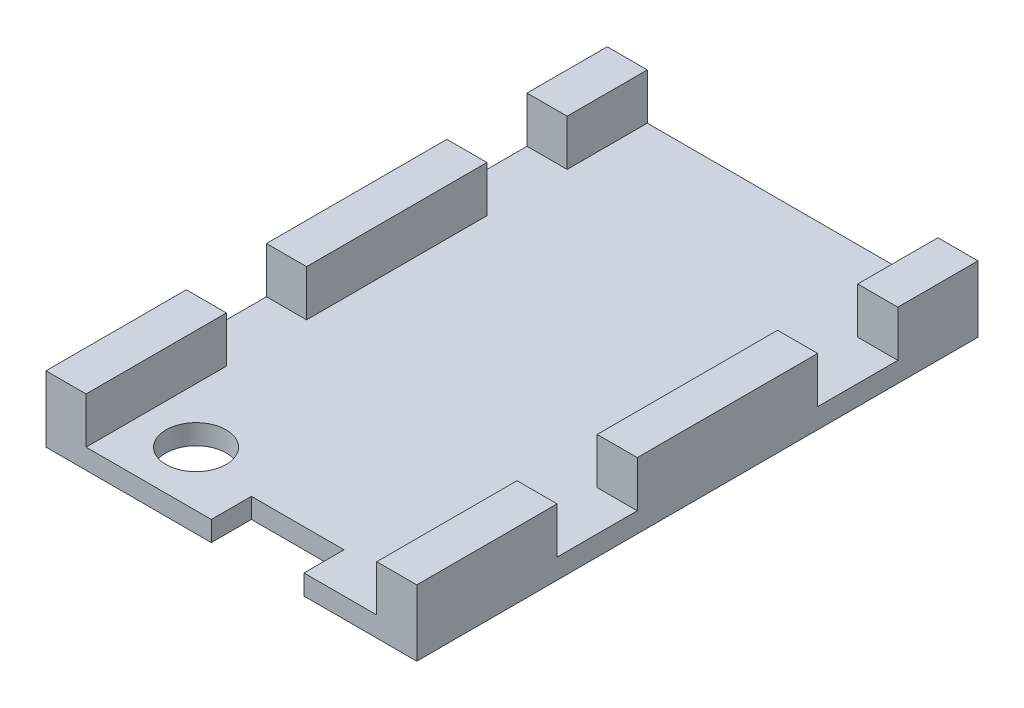
ISO-10303-21;
HEADER;
FILE_DESCRIPTION(('STEP AP214'),'2;1');
FILE_NAME('part.step','',(''),(''),'','','');
FILE_SCHEMA(('AUTOMOTIVE_DESIGN { 1 0 10303 214 1 1 1 1 }'));
ENDSEC;
DATA;
#1=APPLICATION_CONTEXT('core data for automotive mechanical design processes');
#2=APPLICATION_PROTOCOL_DEFINITION('international standard','automotive_design',2000,#1);
#3=PRODUCT_CONTEXT('',#1,'mechanical');
#4=PRODUCT('Part','Part','',(#3));
#5=PRODUCT_RELATED_PRODUCT_CATEGORY('part','',(#4));
#6=PRODUCT_DEFINITION_FORMATION('','',#4);
#7=PRODUCT_DEFINITION_CONTEXT('part definition',#1,'design');
#8=PRODUCT_DEFINITION('design','',#6,#7);
#9=PRODUCT_DEFINITION_SHAPE('','',#8);
#10=(LENGTH_UNIT() NAMED_UNIT(*) SI_UNIT(.MILLI.,.METRE.));
#11=(NAMED_UNIT(*) PLANE_ANGLE_UNIT() SI_UNIT($,.RADIAN.));
#12=(NAMED_UNIT(*) SI_UNIT($,.STERADIAN.) SOLID_ANGLE_UNIT());
#13=UNCERTAINTY_MEASURE_WITH_UNIT(LENGTH_MEASURE(1.E-05),#10,'distance_accuracy_value','');
#14=(GEOMETRIC_REPRESENTATION_CONTEXT(3) GLOBAL_UNCERTAINTY_ASSIGNED_CONTEXT((#13)) GLOBAL_UNIT_ASSIGNED_CONTEXT((#10,
#11,#12)) REPRESENTATION_CONTEXT('',''));
#15=CARTESIAN_POINT('',(0.,0.,0.));
#16=DIRECTION('',(0.,0.,1.));
#17=DIRECTION('',(1.,0.,0.));
#18=AXIS2_PLACEMENT_3D('',#15,#16,#17);
#19=CARTESIAN_POINT('',(-12.7473745827803,3.3,-14.651042113496));
#20=DIRECTION('',(1.,0.,0.));
#21=DIRECTION('',(0.,0.,-1.));
#22=AXIS2_PLACEMENT_3D('',#19,#20,#21);
#23=PLANE('',#22);
#24=DIRECTION('',(0.,0.,1.));
#25=VECTOR('',#24,1.);
#26=CARTESIAN_POINT('',(-12.7473745827803,1.,-14.651042113496));
#27=LINE('',#26,#25);
#28=CARTESIAN_POINT('',(-12.7473745827803,1.,-6.65104211349602));
#29=VERTEX_POINT('',#28);
#30=CARTESIAN_POINT('',(-12.7473745827803,1.,2.34895788650399));
#31=VERTEX_POINT('',#30);
#32=EDGE_CURVE('E244',#29,#31,#27,.T.);
#33=ORIENTED_EDGE('',*,*,#32,.T.);
#34=DIRECTION('',(0.,1.,0.));
#35=VECTOR('',#34,1.);
#36=CARTESIAN_POINT('',(-12.7473745827803,1.,2.34895788650399));
#37=LINE('',#36,#35);
#38=CARTESIAN_POINT('',(-12.7473745827803,3.3,2.34895788650399));
#39=VERTEX_POINT('',#38);
#40=EDGE_CURVE('E384',#31,#39,#37,.T.);
#41=ORIENTED_EDGE('',*,*,#40,.T.);
#42=DIRECTION('',(0.,0.,1.));
#43=VECTOR('',#42,1.);
#44=CARTESIAN_POINT('',(-12.7473745827803,3.3,-14.651042113496));
#45=LINE('',#44,#43);
#46=CARTESIAN_POINT('',(-12.7473745827803,3.3,-6.65104211349602));
#47=VERTEX_POINT('',#46);
#48=EDGE_CURVE('E275',#47,#39,#45,.T.);
#49=ORIENTED_EDGE('',*,*,#48,.F.);
#50=DIRECTION('',(0.,1.,0.));
#51=VECTOR('',#50,1.);
#52=CARTESIAN_POINT('',(-12.7473745827803,1.,-6.65104211349602));
#53=LINE('',#52,#51);
#54=EDGE_CURVE('E59',#29,#47,#53,.T.);
#55=ORIENTED_EDGE('',*,*,#54,.F.);
#56=EDGE_LOOP('',(#33,#41,#49,#55));
#57=FACE_BOUND('',#56,.T.);
#58=ADVANCED_FACE('F33',(#57),#23,.F.);
#59=CARTESIAN_POINT('',(0.,3.3,0.));
#60=DIRECTION('',(0.,-1.,0.));
#61=DIRECTION('',(0.,0.,-1.));
#62=AXIS2_PLACEMENT_3D('',#59,#60,#61);
#63=PLANE('',#62);
#64=ORIENTED_EDGE('',*,*,#48,.T.);
#65=DIRECTION('',(-1.,0.,0.));
#66=VECTOR('',#65,1.);
#67=CARTESIAN_POINT('',(-12.7473745827803,3.3,2.34895788650399));
#68=LINE('',#67,#66);
#69=CARTESIAN_POINT('',(-10.7473745827803,3.3,2.34895788650398));
#70=VERTEX_POINT('',#69);
#71=EDGE_CURVE('E227',#70,#39,#68,.T.);
#72=ORIENTED_EDGE('',*,*,#71,.F.);
#73=DIRECTION('',(0.,0.,-1.));
#74=VECTOR('',#73,1.);
#75=CARTESIAN_POINT('',(-10.7473745827803,3.3,-14.651042113496));
#76=LINE('',#75,#74);
#77=CARTESIAN_POINT('',(-10.7473745827803,3.3,-6.65104211349602));
#78=VERTEX_POINT('',#77);
#79=EDGE_CURVE('E259',#70,#78,#76,.T.);
#80=ORIENTED_EDGE('',*,*,#79,.T.);
#81=DIRECTION('',(1.,0.,0.));
#82=VECTOR('',#81,1.);
#83=CARTESIAN_POINT('',(-12.7473745827803,3.3,-6.65104211349602));
#84=LINE('',#83,#82);
#85=EDGE_CURVE('E381',#47,#78,#84,.T.);
#86=ORIENTED_EDGE('',*,*,#85,.F.);
#87=EDGE_LOOP('',(#64,#72,#80,#86));
#88=FACE_BOUND('',#87,.T.);
#89=ADVANCED_FACE('F485',(#88),#63,.F.);
#90=CARTESIAN_POINT('',(-12.7473745827803,1.,-14.651042113496));
#91=VERTEX_POINT('',#90);
#92=CARTESIAN_POINT('',(-12.7473745827803,1.,-10.651042113496));
#93=VERTEX_POINT('',#92);
#94=EDGE_CURVE('E247',#91,#93,#27,.T.);
#95=ORIENTED_EDGE('',*,*,#94,.T.);
#96=DIRECTION('',(0.,1.,0.));
#97=VECTOR('',#96,1.);
#98=CARTESIAN_POINT('',(-12.7473745827803,1.,-10.651042113496));
#99=LINE('',#98,#97);
#100=CARTESIAN_POINT('',(-12.7473745827803,3.3,-10.651042113496));
#101=VERTEX_POINT('',#100);
#102=EDGE_CURVE('E386',#93,#101,#99,.T.);
#103=ORIENTED_EDGE('',*,*,#102,.T.);
#104=CARTESIAN_POINT('',(-12.7473745827803,3.3,-14.651042113496));
#105=VERTEX_POINT('',#104);
#106=EDGE_CURVE('E277',#105,#101,#45,.T.);
#107=ORIENTED_EDGE('',*,*,#106,.F.);
#108=DIRECTION('',(0.,-1.,0.));
#109=VECTOR('',#108,1.);
#110=CARTESIAN_POINT('',(-12.7473745827803,3.3,-14.651042113496));
#111=LINE('',#110,#109);
#112=EDGE_CURVE('E281',#105,#91,#111,.T.);
#113=ORIENTED_EDGE('',*,*,#112,.T.);
#114=EDGE_LOOP('',(#95,#103,#107,#113));
#115=FACE_BOUND('',#114,.T.);
#116=ADVANCED_FACE('F488',(#115),#23,.F.);
#117=ORIENTED_EDGE('',*,*,#106,.T.);
#118=DIRECTION('',(-1.,0.,0.));
#119=VECTOR('',#118,1.);
#120=CARTESIAN_POINT('',(-12.7473745827803,3.3,-10.651042113496));
#121=LINE('',#120,#119);
#122=CARTESIAN_POINT('',(-10.7473745827803,3.3,-10.651042113496));
#123=VERTEX_POINT('',#122);
#124=EDGE_CURVE('E383',#123,#101,#121,.T.);
#125=ORIENTED_EDGE('',*,*,#124,.F.);
#126=CARTESIAN_POINT('',(-10.7473745827803,3.3,-14.651042113496));
#127=VERTEX_POINT('',#126);
#128=EDGE_CURVE('E255',#123,#127,#76,.T.);
#129=ORIENTED_EDGE('',*,*,#128,.T.);
#130=DIRECTION('',(-1.,0.,0.));
#131=VECTOR('',#130,1.);
#132=CARTESIAN_POINT('',(-10.7473745827803,3.3,-14.651042113496));
#133=LINE('',#132,#131);
#134=EDGE_CURVE('E268',#127,#105,#133,.T.);
#135=ORIENTED_EDGE('',*,*,#134,.T.);
#136=EDGE_LOOP('',(#117,#125,#129,#135));
#137=FACE_BOUND('',#136,.T.);
#138=ADVANCED_FACE('F494',(#137),#63,.F.);
#139=CARTESIAN_POINT('',(-27.2473745827803,3.3,-14.651042113496));
#140=DIRECTION('',(-1.,0.,0.));
#141=DIRECTION('',(0.,0.,1.));
#142=AXIS2_PLACEMENT_3D('',#139,#140,#141);
#143=PLANE('',#142);
#144=DIRECTION('',(0.,0.,-1.));
#145=VECTOR('',#144,1.);
#146=CARTESIAN_POINT('',(-27.2473745827803,3.3,-14.651042113496));
#147=LINE('',#146,#145);
#148=CARTESIAN_POINT('',(-27.2473745827803,3.3,2.34895788650398));
#149=VERTEX_POINT('',#148);
#150=CARTESIAN_POINT('',(-27.2473745827803,3.3,-6.65104211349602));
#151=VERTEX_POINT('',#150);
#152=EDGE_CURVE('E298',#149,#151,#147,.T.);
#153=ORIENTED_EDGE('',*,*,#152,.F.);
#154=DIRECTION('',(0.,1.,0.));
#155=VECTOR('',#154,1.);
#156=CARTESIAN_POINT('',(-27.2473745827803,1.,2.34895788650398));
#157=LINE('',#156,#155);
#158=CARTESIAN_POINT('',(-27.2473745827803,1.,2.34895788650398));
#159=VERTEX_POINT('',#158);
#160=EDGE_CURVE('E410',#159,#149,#157,.T.);
#161=ORIENTED_EDGE('',*,*,#160,.F.);
#162=DIRECTION('',(0.,0.,-1.));
#163=VECTOR('',#162,1.);
#164=CARTESIAN_POINT('',(-27.2473745827803,1.,-14.651042113496));
#165=LINE('',#164,#163);
#166=CARTESIAN_POINT('',(-27.2473745827803,1.,-6.65104211349602));
#167=VERTEX_POINT('',#166);
#168=EDGE_CURVE('E37',#159,#167,#165,.T.);
#169=ORIENTED_EDGE('',*,*,#168,.T.);
#170=DIRECTION('',(0.,1.,0.));
#171=VECTOR('',#170,1.);
#172=CARTESIAN_POINT('',(-27.2473745827803,1.,-6.65104211349602));
#173=LINE('',#172,#171);
#174=EDGE_CURVE('E434',#167,#151,#173,.T.);
#175=ORIENTED_EDGE('',*,*,#174,.T.);
#176=EDGE_LOOP('',(#153,#161,#169,#175));
#177=FACE_BOUND('',#176,.T.);
#178=ADVANCED_FACE('F478',(#177),#143,.F.);
#179=CARTESIAN_POINT('',(0.,3.3,0.));
#180=DIRECTION('',(0.,1.,0.));
#181=DIRECTION('',(0.,0.,1.));
#182=AXIS2_PLACEMENT_3D('',#179,#180,#181);
#183=PLANE('',#182);
#184=DIRECTION('',(-1.,0.,0.));
#185=VECTOR('',#184,1.);
#186=CARTESIAN_POINT('',(-29.2473745827803,3.3,2.34895788650398));
#187=LINE('',#186,#185);
#188=CARTESIAN_POINT('',(-29.2473745827803,3.3,2.34895788650398));
#189=VERTEX_POINT('',#188);
#190=EDGE_CURVE('E397',#149,#189,#187,.T.);
#191=ORIENTED_EDGE('',*,*,#190,.F.);
#192=ORIENTED_EDGE('',*,*,#152,.T.);
#193=DIRECTION('',(1.,0.,0.));
#194=VECTOR('',#193,1.);
#195=CARTESIAN_POINT('',(-29.2473745827803,3.3,-6.65104211349602));
#196=LINE('',#195,#194);
#197=CARTESIAN_POINT('',(-29.2473745827803,3.3,-6.65104211349602));
#198=VERTEX_POINT('',#197);
#199=EDGE_CURVE('E409',#198,#151,#196,.T.);
#200=ORIENTED_EDGE('',*,*,#199,.F.);
#201=DIRECTION('',(0.,0.,1.));
#202=VECTOR('',#201,1.);
#203=CARTESIAN_POINT('',(-29.2473745827803,3.3,-14.651042113496));
#204=LINE('',#203,#202);
#205=EDGE_CURVE('E290',#198,#189,#204,.T.);
#206=ORIENTED_EDGE('',*,*,#205,.T.);
#207=EDGE_LOOP('',(#191,#192,#200,#206));
#208=FACE_BOUND('',#207,.T.);
#209=ADVANCED_FACE('F504',(#208),#183,.T.);
#210=CARTESIAN_POINT('',(-27.2473745827803,3.3,-10.651042113496));
#211=VERTEX_POINT('',#210);
#212=CARTESIAN_POINT('',(-27.2473745827803,3.3,-14.651042113496));
#213=VERTEX_POINT('',#212);
#214=EDGE_CURVE('E293',#211,#213,#147,.T.);
#215=ORIENTED_EDGE('',*,*,#214,.F.);
#216=DIRECTION('',(0.,1.,0.));
#217=VECTOR('',#216,1.);
#218=CARTESIAN_POINT('',(-27.2473745827803,1.,-10.651042113496));
#219=LINE('',#218,#217);
#220=CARTESIAN_POINT('',(-27.2473745827803,1.,-10.651042113496));
#221=VERTEX_POINT('',#220);
#222=EDGE_CURVE('E364',#221,#211,#219,.T.);
#223=ORIENTED_EDGE('',*,*,#222,.F.);
#224=CARTESIAN_POINT('',(-27.2473745827803,1.,-14.651042113496));
#225=VERTEX_POINT('',#224);
#226=EDGE_CURVE('E283',#221,#225,#165,.T.);
#227=ORIENTED_EDGE('',*,*,#226,.T.);
#228=DIRECTION('',(0.,-1.,0.));
#229=VECTOR('',#228,1.);
#230=CARTESIAN_POINT('',(-27.2473745827803,3.3,-14.651042113496));
#231=LINE('',#230,#229);
#232=EDGE_CURVE('E300',#213,#225,#231,.T.);
#233=ORIENTED_EDGE('',*,*,#232,.F.);
#234=EDGE_LOOP('',(#215,#223,#227,#233));
#235=FACE_BOUND('',#234,.T.);
#236=ADVANCED_FACE('F361',(#235),#143,.F.);
#237=DIRECTION('',(-1.,0.,0.));
#238=VECTOR('',#237,1.);
#239=CARTESIAN_POINT('',(-29.2473745827803,3.3,-10.651042113496));
#240=LINE('',#239,#238);
#241=CARTESIAN_POINT('',(-29.2473745827803,3.3,-10.651042113496));
#242=VERTEX_POINT('',#241);
#243=EDGE_CURVE('E420',#211,#242,#240,.T.);
#244=ORIENTED_EDGE('',*,*,#243,.F.);
#245=ORIENTED_EDGE('',*,*,#214,.T.);
#246=DIRECTION('',(-1.,0.,0.));
#247=VECTOR('',#246,1.);
#248=CARTESIAN_POINT('',(-29.2473745827803,3.3,-14.651042113496));
#249=LINE('',#248,#247);
#250=CARTESIAN_POINT('',(-29.2473745827803,3.3,-14.651042113496));
#251=VERTEX_POINT('',#250);
#252=EDGE_CURVE('E297',#213,#251,#249,.T.);
#253=ORIENTED_EDGE('',*,*,#252,.T.);
#254=EDGE_CURVE('E286',#251,#242,#204,.T.);
#255=ORIENTED_EDGE('',*,*,#254,.T.);
#256=EDGE_LOOP('',(#244,#245,#253,#255));
#257=FACE_BOUND('',#256,.T.);
#258=ADVANCED_FACE('F505',(#257),#183,.T.);
#259=CARTESIAN_POINT('',(-29.2473745827803,1.,13.348957886504));
#260=DIRECTION('',(0.,0.,-1.));
#261=DIRECTION('',(-1.,0.,0.));
#262=AXIS2_PLACEMENT_3D('',#259,#260,#261);
#263=PLANE('',#262);
#264=DIRECTION('',(1.,0.,0.));
#265=VECTOR('',#264,1.);
#266=CARTESIAN_POINT('',(-29.2473745827803,1.,13.348957886504));
#267=LINE('',#266,#265);
#268=CARTESIAN_POINT('',(-16.3765745827803,1.,13.348957886504));
#269=VERTEX_POINT('',#268);
#270=CARTESIAN_POINT('',(-12.7473745827803,1.,13.348957886504));
#271=VERTEX_POINT('',#270);
#272=EDGE_CURVE('E242',#269,#271,#267,.T.);
#273=ORIENTED_EDGE('',*,*,#272,.F.);
#274=DIRECTION('',(0.,-1.,0.));
#275=VECTOR('',#274,1.);
#276=CARTESIAN_POINT('',(-16.3765745827803,2.3,13.348957886504));
#277=LINE('',#276,#275);
#278=CARTESIAN_POINT('',(-16.3765745827803,0.,13.348957886504));
#279=VERTEX_POINT('',#278);
#280=EDGE_CURVE('E445',#269,#279,#277,.T.);
#281=ORIENTED_EDGE('',*,*,#280,.T.);
#282=DIRECTION('',(1.,0.,0.));
#283=VECTOR('',#282,1.);
#284=CARTESIAN_POINT('',(-29.2473745827803,0.,13.348957886504));
#285=LINE('',#284,#283);
#286=CARTESIAN_POINT('',(-10.7473745827803,0.,13.348957886504));
#287=VERTEX_POINT('',#286);
#288=EDGE_CURVE('E337',#279,#287,#285,.T.);
#289=ORIENTED_EDGE('',*,*,#288,.T.);
#290=DIRECTION('',(0.,-1.,0.));
#291=VECTOR('',#290,1.);
#292=CARTESIAN_POINT('',(-10.7473745827803,1.,13.348957886504));
#293=LINE('',#292,#291);
#294=CARTESIAN_POINT('',(-10.7473745827803,3.3,13.348957886504));
#295=VERTEX_POINT('',#294);
#296=EDGE_CURVE('E329',#295,#287,#293,.T.);
#297=ORIENTED_EDGE('',*,*,#296,.F.);
#298=DIRECTION('',(1.,0.,0.));
#299=VECTOR('',#298,1.);
#300=CARTESIAN_POINT('',(-10.7473745827803,3.3,13.348957886504));
#301=LINE('',#300,#299);
#302=CARTESIAN_POINT('',(-12.7473745827803,3.3,13.348957886504));
#303=VERTEX_POINT('',#302);
#304=EDGE_CURVE('E278',#303,#295,#301,.T.);
#305=ORIENTED_EDGE('',*,*,#304,.F.);
#306=DIRECTION('',(0.,-1.,0.));
#307=VECTOR('',#306,1.);
#308=CARTESIAN_POINT('',(-12.7473745827803,3.3,13.348957886504));
#309=LINE('',#308,#307);
#310=EDGE_CURVE('E279',#303,#271,#309,.T.);
#311=ORIENTED_EDGE('',*,*,#310,.T.);
#312=EDGE_LOOP('',(#273,#281,#289,#297,#305,#311));
#313=FACE_BOUND('',#312,.T.);
#314=ADVANCED_FACE('F512',(#313),#263,.F.);
#315=CARTESIAN_POINT('',(0.,1.,0.));
#316=DIRECTION('',(0.,-1.,0.));
#317=DIRECTION('',(0.,0.,-1.));
#318=AXIS2_PLACEMENT_3D('',#315,#316,#317);
#319=PLANE('',#318);
#320=CARTESIAN_POINT('',(-24.5043745827803,1.,10.605757886504));
#321=DIRECTION('',(0.,-1.,0.));
#322=DIRECTION('',(0.,0.,-1.));
#323=AXIS2_PLACEMENT_3D('',#320,#321,#322);
#324=CIRCLE('',#323,1.5);
#325=CARTESIAN_POINT('',(-24.5043745827803,1.,9.10575788650399));
#326=VERTEX_POINT('',#325);
#327=EDGE_CURVE('E245',#326,#326,#324,.T.);
#328=ORIENTED_EDGE('',*,*,#327,.T.);
#329=EDGE_LOOP('',(#328));
#330=FACE_BOUND('',#329,.T.);
#331=DIRECTION('',(1.,0.,0.));
#332=VECTOR('',#331,1.);
#333=CARTESIAN_POINT('',(0.,1.,11.348957886504));
#334=LINE('',#333,#332);
#335=CARTESIAN_POINT('',(-20.9993745827803,1.,11.348957886504));
#336=VERTEX_POINT('',#335);
#337=CARTESIAN_POINT('',(-16.3765745827803,1.,11.348957886504));
#338=VERTEX_POINT('',#337);
#339=EDGE_CURVE('E457',#336,#338,#334,.T.);
#340=ORIENTED_EDGE('',*,*,#339,.T.);
#341=DIRECTION('',(0.,0.,1.));
#342=VECTOR('',#341,1.);
#343=CARTESIAN_POINT('',(-16.3765745827803,1.,0.));
#344=LINE('',#343,#342);
#345=EDGE_CURVE('E459',#338,#269,#344,.T.);
#346=ORIENTED_EDGE('',*,*,#345,.T.);
#347=ORIENTED_EDGE('',*,*,#272,.T.);
#348=CARTESIAN_POINT('',(-12.7473745827803,1.,6.34895788650398));
#349=VERTEX_POINT('',#348);
#350=EDGE_CURVE('E233',#349,#271,#27,.T.);
#351=ORIENTED_EDGE('',*,*,#350,.F.);
#352=DIRECTION('',(1.,0.,0.));
#353=VECTOR('',#352,1.);
#354=CARTESIAN_POINT('',(-12.7473745827803,1.,6.34895788650398));
#355=LINE('',#354,#353);
#356=CARTESIAN_POINT('',(-10.7473745827803,1.,6.34895788650398));
#357=VERTEX_POINT('',#356);
#358=EDGE_CURVE('E219',#349,#357,#355,.T.);
#359=ORIENTED_EDGE('',*,*,#358,.T.);
#360=DIRECTION('',(0.,0.,-1.));
#361=VECTOR('',#360,1.);
#362=CARTESIAN_POINT('',(-10.7473745827803,1.,2.34895788650398));
#363=LINE('',#362,#361);
#364=CARTESIAN_POINT('',(-10.7473745827803,1.,2.34895788650398));
#365=VERTEX_POINT('',#364);
#366=EDGE_CURVE('E226',#357,#365,#363,.T.);
#367=ORIENTED_EDGE('',*,*,#366,.T.);
#368=DIRECTION('',(-1.,0.,0.));
#369=VECTOR('',#368,1.);
#370=CARTESIAN_POINT('',(-12.7473745827803,1.,2.34895788650399));
#371=LINE('',#370,#369);
#372=EDGE_CURVE('E236',#365,#31,#371,.T.);
#373=ORIENTED_EDGE('',*,*,#372,.T.);
#374=ORIENTED_EDGE('',*,*,#32,.F.);
#375=DIRECTION('',(1.,0.,0.));
#376=VECTOR('',#375,1.);
#377=CARTESIAN_POINT('',(-12.7473745827803,1.,-6.65104211349602));
#378=LINE('',#377,#376);
#379=CARTESIAN_POINT('',(-10.7473745827803,1.,-6.65104211349602));
#380=VERTEX_POINT('',#379);
#381=EDGE_CURVE('E377',#29,#380,#378,.T.);
#382=ORIENTED_EDGE('',*,*,#381,.T.);
#383=DIRECTION('',(0.,0.,-1.));
#384=VECTOR('',#383,1.);
#385=CARTESIAN_POINT('',(-10.7473745827803,1.,-10.651042113496));
#386=LINE('',#385,#384);
#387=CARTESIAN_POINT('',(-10.7473745827803,1.,-10.651042113496));
#388=VERTEX_POINT('',#387);
#389=EDGE_CURVE('E371',#380,#388,#386,.T.);
#390=ORIENTED_EDGE('',*,*,#389,.T.);
#391=DIRECTION('',(-1.,0.,0.));
#392=VECTOR('',#391,1.);
#393=CARTESIAN_POINT('',(-12.7473745827803,1.,-10.651042113496));
#394=LINE('',#393,#392);
#395=EDGE_CURVE('E368',#388,#93,#394,.T.);
#396=ORIENTED_EDGE('',*,*,#395,.T.);
#397=ORIENTED_EDGE('',*,*,#94,.F.);
#398=DIRECTION('',(1.,0.,0.));
#399=VECTOR('',#398,1.);
#400=CARTESIAN_POINT('',(-29.2473745827803,1.,-14.651042113496));
#401=LINE('',#400,#399);
#402=EDGE_CURVE('E314',#225,#91,#401,.T.);
#403=ORIENTED_EDGE('',*,*,#402,.F.);
#404=ORIENTED_EDGE('',*,*,#226,.F.);
#405=DIRECTION('',(-1.,0.,0.));
#406=VECTOR('',#405,1.);
#407=CARTESIAN_POINT('',(-29.2473745827803,1.,-10.651042113496));
#408=LINE('',#407,#406);
#409=CARTESIAN_POINT('',(-29.2473745827803,1.,-10.651042113496));
#410=VERTEX_POINT('',#409);
#411=EDGE_CURVE('E423',#221,#410,#408,.T.);
#412=ORIENTED_EDGE('',*,*,#411,.T.);
#413=DIRECTION('',(0.,0.,1.));
#414=VECTOR('',#413,1.);
#415=CARTESIAN_POINT('',(-29.2473745827803,1.,-10.651042113496));
#416=LINE('',#415,#414);
#417=CARTESIAN_POINT('',(-29.2473745827803,1.,-6.65104211349602));
#418=VERTEX_POINT('',#417);
#419=EDGE_CURVE('E416',#410,#418,#416,.T.);
#420=ORIENTED_EDGE('',*,*,#419,.T.);
#421=DIRECTION('',(1.,0.,0.));
#422=VECTOR('',#421,1.);
#423=CARTESIAN_POINT('',(-29.2473745827803,1.,-6.65104211349602));
#424=LINE('',#423,#422);
#425=EDGE_CURVE('E419',#418,#167,#424,.T.);
#426=ORIENTED_EDGE('',*,*,#425,.T.);
#427=ORIENTED_EDGE('',*,*,#168,.F.);
#428=DIRECTION('',(-1.,0.,0.));
#429=VECTOR('',#428,1.);
#430=CARTESIAN_POINT('',(-29.2473745827803,1.,2.34895788650398));
#431=LINE('',#430,#429);
#432=CARTESIAN_POINT('',(-29.2473745827803,1.,2.34895788650398));
#433=VERTEX_POINT('',#432);
#434=EDGE_CURVE('E400',#159,#433,#431,.T.);
#435=ORIENTED_EDGE('',*,*,#434,.T.);
#436=DIRECTION('',(0.,0.,1.));
#437=VECTOR('',#436,1.);
#438=CARTESIAN_POINT('',(-29.2473745827803,1.,2.34895788650398));
#439=LINE('',#438,#437);
#440=CARTESIAN_POINT('',(-29.2473745827803,1.,6.34895788650398));
#441=VERTEX_POINT('',#440);
#442=EDGE_CURVE('E393',#433,#441,#439,.T.);
#443=ORIENTED_EDGE('',*,*,#442,.T.);
#444=DIRECTION('',(1.,0.,0.));
#445=VECTOR('',#444,1.);
#446=CARTESIAN_POINT('',(-29.2473745827803,1.,6.34895788650398));
#447=LINE('',#446,#445);
#448=CARTESIAN_POINT('',(-27.2473745827803,1.,6.34895788650398));
#449=VERTEX_POINT('',#448);
#450=EDGE_CURVE('E396',#441,#449,#447,.T.);
#451=ORIENTED_EDGE('',*,*,#450,.T.);
#452=CARTESIAN_POINT('',(-27.2473745827803,1.,13.348957886504));
#453=VERTEX_POINT('',#452);
#454=EDGE_CURVE('E308',#453,#449,#165,.T.);
#455=ORIENTED_EDGE('',*,*,#454,.F.);
#456=CARTESIAN_POINT('',(-20.9993745827803,1.,13.348957886504));
#457=VERTEX_POINT('',#456);
#458=EDGE_CURVE('E313',#453,#457,#267,.T.);
#459=ORIENTED_EDGE('',*,*,#458,.T.);
#460=DIRECTION('',(0.,0.,-1.));
#461=VECTOR('',#460,1.);
#462=CARTESIAN_POINT('',(-20.9993745827803,1.,0.));
#463=LINE('',#462,#461);
#464=EDGE_CURVE('E448',#457,#336,#463,.T.);
#465=ORIENTED_EDGE('',*,*,#464,.T.);
#466=EDGE_LOOP('',(#340,#346,#347,#351,#359,#367,#373,#374,#382,#390,#396,#397,#403,#404,#412,
#420,#426,#427,#435,#443,#451,#455,#459,#465));
#467=FACE_BOUND('',#466,.T.);
#468=ADVANCED_FACE('F239',(#330,#467),#319,.F.);
#469=CARTESIAN_POINT('',(-29.2473745827803,1.,-14.651042113496));
#470=DIRECTION('',(0.,0.,-1.));
#471=DIRECTION('',(-1.,0.,0.));
#472=AXIS2_PLACEMENT_3D('',#469,#470,#471);
#473=PLANE('',#472);
#474=DIRECTION('',(1.,0.,0.));
#475=VECTOR('',#474,1.);
#476=CARTESIAN_POINT('',(-29.2473745827803,0.,-14.651042113496));
#477=LINE('',#476,#475);
#478=CARTESIAN_POINT('',(-29.2473745827803,0.,-14.651042113496));
#479=VERTEX_POINT('',#478);
#480=CARTESIAN_POINT('',(-10.7473745827803,0.,-14.651042113496));
#481=VERTEX_POINT('',#480);
#482=EDGE_CURVE('E319',#479,#481,#477,.T.);
#483=ORIENTED_EDGE('',*,*,#482,.F.);
#484=DIRECTION('',(0.,-1.,0.));
#485=VECTOR('',#484,1.);
#486=CARTESIAN_POINT('',(-29.2473745827803,1.,-14.651042113496));
#487=LINE('',#486,#485);
#488=EDGE_CURVE('E11',#251,#479,#487,.T.);
#489=ORIENTED_EDGE('',*,*,#488,.F.);
#490=ORIENTED_EDGE('',*,*,#252,.F.);
#491=ORIENTED_EDGE('',*,*,#232,.T.);
#492=ORIENTED_EDGE('',*,*,#402,.T.);
#493=ORIENTED_EDGE('',*,*,#112,.F.);
#494=ORIENTED_EDGE('',*,*,#134,.F.);
#495=DIRECTION('',(0.,-1.,0.));
#496=VECTOR('',#495,1.);
#497=CARTESIAN_POINT('',(-10.7473745827803,1.,-14.651042113496));
#498=LINE('',#497,#496);
#499=EDGE_CURVE('E324',#127,#481,#498,.T.);
#500=ORIENTED_EDGE('',*,*,#499,.T.);
#501=EDGE_LOOP('',(#483,#489,#490,#491,#492,#493,#494,#500));
#502=FACE_BOUND('',#501,.T.);
#503=ADVANCED_FACE('F35',(#502),#473,.T.);
#504=CARTESIAN_POINT('',(-29.2473745827803,1.,-14.651042113496));
#505=DIRECTION('',(1.,0.,0.));
#506=DIRECTION('',(0.,0.,-1.));
#507=AXIS2_PLACEMENT_3D('',#504,#505,#506);
#508=PLANE('',#507);
#509=ORIENTED_EDGE('',*,*,#442,.F.);
#510=DIRECTION('',(0.,1.,0.));
#511=VECTOR('',#510,1.);
#512=CARTESIAN_POINT('',(-29.2473745827803,1.,2.34895788650398));
#513=LINE('',#512,#511);
#514=EDGE_CURVE('E406',#433,#189,#513,.T.);
#515=ORIENTED_EDGE('',*,*,#514,.T.);
#516=ORIENTED_EDGE('',*,*,#205,.F.);
#517=DIRECTION('',(0.,1.,0.));
#518=VECTOR('',#517,1.);
#519=CARTESIAN_POINT('',(-29.2473745827803,1.,-6.65104211349602));
#520=LINE('',#519,#518);
#521=EDGE_CURVE('E425',#418,#198,#520,.T.);
#522=ORIENTED_EDGE('',*,*,#521,.F.);
#523=ORIENTED_EDGE('',*,*,#419,.F.);
#524=DIRECTION('',(0.,1.,0.));
#525=VECTOR('',#524,1.);
#526=CARTESIAN_POINT('',(-29.2473745827803,1.,-10.651042113496));
#527=LINE('',#526,#525);
#528=EDGE_CURVE('E429',#410,#242,#527,.T.);
#529=ORIENTED_EDGE('',*,*,#528,.T.);
#530=ORIENTED_EDGE('',*,*,#254,.F.);
#531=ORIENTED_EDGE('',*,*,#488,.T.);
#532=DIRECTION('',(0.,0.,1.));
#533=VECTOR('',#532,1.);
#534=CARTESIAN_POINT('',(-29.2473745827803,0.,-14.651042113496));
#535=LINE('',#534,#533);
#536=CARTESIAN_POINT('',(-29.2473745827803,0.,13.348957886504));
#537=VERTEX_POINT('',#536);
#538=EDGE_CURVE('E327',#479,#537,#535,.T.);
#539=ORIENTED_EDGE('',*,*,#538,.T.);
#540=DIRECTION('',(0.,-1.,0.));
#541=VECTOR('',#540,1.);
#542=CARTESIAN_POINT('',(-29.2473745827803,1.,13.348957886504));
#543=LINE('',#542,#541);
#544=CARTESIAN_POINT('',(-29.2473745827803,3.3,13.348957886504));
#545=VERTEX_POINT('',#544);
#546=EDGE_CURVE('E43',#545,#537,#543,.T.);
#547=ORIENTED_EDGE('',*,*,#546,.F.);
#548=CARTESIAN_POINT('',(-29.2473745827803,3.3,6.34895788650399));
#549=VERTEX_POINT('',#548);
#550=EDGE_CURVE('E291',#549,#545,#204,.T.);
#551=ORIENTED_EDGE('',*,*,#550,.F.);
#552=DIRECTION('',(0.,1.,0.));
#553=VECTOR('',#552,1.);
#554=CARTESIAN_POINT('',(-29.2473745827803,1.,6.34895788650398));
#555=LINE('',#554,#553);
#556=EDGE_CURVE('E403',#441,#549,#555,.T.);
#557=ORIENTED_EDGE('',*,*,#556,.F.);
#558=EDGE_LOOP('',(#509,#515,#516,#522,#523,#529,#530,#531,#539,#547,#551,#557));
#559=FACE_BOUND('',#558,.T.);
#560=ADVANCED_FACE('F526',(#559),#508,.F.);
#561=CARTESIAN_POINT('',(-20.9993745827803,0.,13.348957886504));
#562=VERTEX_POINT('',#561);
#563=EDGE_CURVE('E335',#537,#562,#285,.T.);
#564=ORIENTED_EDGE('',*,*,#563,.T.);
#565=DIRECTION('',(0.,-1.,0.));
#566=VECTOR('',#565,1.);
#567=CARTESIAN_POINT('',(-20.9993745827803,2.3,13.348957886504));
#568=LINE('',#567,#566);
#569=EDGE_CURVE('E451',#457,#562,#568,.T.);
#570=ORIENTED_EDGE('',*,*,#569,.F.);
#571=ORIENTED_EDGE('',*,*,#458,.F.);
#572=DIRECTION('',(0.,-1.,0.));
#573=VECTOR('',#572,1.);
#574=CARTESIAN_POINT('',(-27.2473745827803,3.3,13.348957886504));
#575=LINE('',#574,#573);
#576=CARTESIAN_POINT('',(-27.2473745827803,3.3,13.348957886504));
#577=VERTEX_POINT('',#576);
#578=EDGE_CURVE('E344',#577,#453,#575,.T.);
#579=ORIENTED_EDGE('',*,*,#578,.F.);
#580=DIRECTION('',(1.,0.,0.));
#581=VECTOR('',#580,1.);
#582=CARTESIAN_POINT('',(-29.2473745827803,3.3,13.348957886504));
#583=LINE('',#582,#581);
#584=EDGE_CURVE('E289',#545,#577,#583,.T.);
#585=ORIENTED_EDGE('',*,*,#584,.F.);
#586=ORIENTED_EDGE('',*,*,#546,.T.);
#587=EDGE_LOOP('',(#564,#570,#571,#579,#585,#586));
#588=FACE_BOUND('',#587,.T.);
#589=ADVANCED_FACE('F479',(#588),#263,.F.);
#590=CARTESIAN_POINT('',(-10.7473745827803,1.,-14.651042113496));
#591=DIRECTION('',(1.,0.,0.));
#592=DIRECTION('',(0.,0.,-1.));
#593=AXIS2_PLACEMENT_3D('',#590,#591,#592);
#594=PLANE('',#593);
#595=DIRECTION('',(0.,1.,0.));
#596=VECTOR('',#595,1.);
#597=CARTESIAN_POINT('',(-10.7473745827803,1.,2.34895788650398));
#598=LINE('',#597,#596);
#599=EDGE_CURVE('E562',#365,#70,#598,.T.);
#600=ORIENTED_EDGE('',*,*,#599,.F.);
#601=ORIENTED_EDGE('',*,*,#366,.F.);
#602=DIRECTION('',(0.,1.,0.));
#603=VECTOR('',#602,1.);
#604=CARTESIAN_POINT('',(-10.7473745827803,1.,6.34895788650398));
#605=LINE('',#604,#603);
#606=CARTESIAN_POINT('',(-10.7473745827803,3.3,6.34895788650398));
#607=VERTEX_POINT('',#606);
#608=EDGE_CURVE('E222',#357,#607,#605,.T.);
#609=ORIENTED_EDGE('',*,*,#608,.T.);
#610=EDGE_CURVE('E261',#295,#607,#76,.T.);
#611=ORIENTED_EDGE('',*,*,#610,.F.);
#612=ORIENTED_EDGE('',*,*,#296,.T.);
#613=DIRECTION('',(0.,0.,1.));
#614=VECTOR('',#613,1.);
#615=CARTESIAN_POINT('',(-10.7473745827803,0.,-14.651042113496));
#616=LINE('',#615,#614);
#617=EDGE_CURVE('E338',#481,#287,#616,.T.);
#618=ORIENTED_EDGE('',*,*,#617,.F.);
#619=ORIENTED_EDGE('',*,*,#499,.F.);
#620=ORIENTED_EDGE('',*,*,#128,.F.);
#621=DIRECTION('',(0.,1.,0.));
#622=VECTOR('',#621,1.);
#623=CARTESIAN_POINT('',(-10.7473745827803,1.,-10.651042113496));
#624=LINE('',#623,#622);
#625=EDGE_CURVE('E389',#388,#123,#624,.T.);
#626=ORIENTED_EDGE('',*,*,#625,.F.);
#627=ORIENTED_EDGE('',*,*,#389,.F.);
#628=DIRECTION('',(0.,1.,0.));
#629=VECTOR('',#628,1.);
#630=CARTESIAN_POINT('',(-10.7473745827803,1.,-6.65104211349602));
#631=LINE('',#630,#629);
#632=EDGE_CURVE('E375',#380,#78,#631,.T.);
#633=ORIENTED_EDGE('',*,*,#632,.T.);
#634=ORIENTED_EDGE('',*,*,#79,.F.);
#635=EDGE_LOOP('',(#600,#601,#609,#611,#612,#618,#619,#620,#626,#627,#633,#634));
#636=FACE_BOUND('',#635,.T.);
#637=ADVANCED_FACE('F470',(#636),#594,.T.);
#638=CARTESIAN_POINT('',(0.,0.,0.));
#639=DIRECTION('',(0.,-1.,0.));
#640=DIRECTION('',(0.,0.,-1.));
#641=AXIS2_PLACEMENT_3D('',#638,#639,#640);
#642=PLANE('',#641);
#643=DIRECTION('',(0.,0.,1.));
#644=VECTOR('',#643,1.);
#645=CARTESIAN_POINT('',(-16.3765745827803,0.,13.348957886504));
#646=LINE('',#645,#644);
#647=CARTESIAN_POINT('',(-16.3765745827803,0.,11.348957886504));
#648=VERTEX_POINT('',#647);
#649=EDGE_CURVE('E432',#648,#279,#646,.T.);
#650=ORIENTED_EDGE('',*,*,#649,.F.);
#651=DIRECTION('',(1.,0.,0.));
#652=VECTOR('',#651,1.);
#653=CARTESIAN_POINT('',(-16.3765745827803,0.,11.348957886504));
#654=LINE('',#653,#652);
#655=CARTESIAN_POINT('',(-20.9993745827803,0.,11.348957886504));
#656=VERTEX_POINT('',#655);
#657=EDGE_CURVE('E442',#656,#648,#654,.T.);
#658=ORIENTED_EDGE('',*,*,#657,.F.);
#659=DIRECTION('',(0.,0.,-1.));
#660=VECTOR('',#659,1.);
#661=CARTESIAN_POINT('',(-20.9993745827803,0.,13.348957886504));
#662=LINE('',#661,#660);
#663=EDGE_CURVE('E439',#562,#656,#662,.T.);
#664=ORIENTED_EDGE('',*,*,#663,.F.);
#665=ORIENTED_EDGE('',*,*,#563,.F.);
#666=ORIENTED_EDGE('',*,*,#538,.F.);
#667=ORIENTED_EDGE('',*,*,#482,.T.);
#668=ORIENTED_EDGE('',*,*,#617,.T.);
#669=ORIENTED_EDGE('',*,*,#288,.F.);
#670=EDGE_LOOP('',(#650,#658,#664,#665,#666,#667,#668,#669));
#671=FACE_BOUND('',#670,.T.);
#672=CARTESIAN_POINT('',(-24.5043745827803,0.,10.605757886504));
#673=DIRECTION('',(0.,-1.,0.));
#674=DIRECTION('',(0.,0.,-1.));
#675=AXIS2_PLACEMENT_3D('',#672,#673,#674);
#676=CIRCLE('',#675,1.5);
#677=CARTESIAN_POINT('',(-24.5043745827803,0.,9.10575788650399));
#678=VERTEX_POINT('',#677);
#679=EDGE_CURVE('E250',#678,#678,#676,.T.);
#680=ORIENTED_EDGE('',*,*,#679,.F.);
#681=EDGE_LOOP('',(#680));
#682=FACE_BOUND('',#681,.T.);
#683=ADVANCED_FACE('F467',(#671,#682),#642,.T.);
#684=ORIENTED_EDGE('',*,*,#454,.T.);
#685=DIRECTION('',(0.,1.,0.));
#686=VECTOR('',#685,1.);
#687=CARTESIAN_POINT('',(-27.2473745827803,1.,6.34895788650398));
#688=LINE('',#687,#686);
#689=CARTESIAN_POINT('',(-27.2473745827803,3.3,6.34895788650398));
#690=VERTEX_POINT('',#689);
#691=EDGE_CURVE('E412',#449,#690,#688,.T.);
#692=ORIENTED_EDGE('',*,*,#691,.T.);
#693=EDGE_CURVE('E294',#577,#690,#147,.T.);
#694=ORIENTED_EDGE('',*,*,#693,.F.);
#695=ORIENTED_EDGE('',*,*,#578,.T.);
#696=EDGE_LOOP('',(#684,#692,#694,#695));
#697=FACE_BOUND('',#696,.T.);
#698=ADVANCED_FACE('F469',(#697),#143,.F.);
#699=DIRECTION('',(1.,0.,0.));
#700=VECTOR('',#699,1.);
#701=CARTESIAN_POINT('',(-29.2473745827803,3.3,6.34895788650398));
#702=LINE('',#701,#700);
#703=EDGE_CURVE('E388',#549,#690,#702,.T.);
#704=ORIENTED_EDGE('',*,*,#703,.F.);
#705=ORIENTED_EDGE('',*,*,#550,.T.);
#706=ORIENTED_EDGE('',*,*,#584,.T.);
#707=ORIENTED_EDGE('',*,*,#693,.T.);
#708=EDGE_LOOP('',(#704,#705,#706,#707));
#709=FACE_BOUND('',#708,.T.);
#710=ADVANCED_FACE('F476',(#709),#183,.T.);
#711=CARTESIAN_POINT('',(-12.7473745827803,3.3,6.34895788650399));
#712=VERTEX_POINT('',#711);
#713=EDGE_CURVE('E235',#712,#303,#45,.T.);
#714=ORIENTED_EDGE('',*,*,#713,.F.);
#715=DIRECTION('',(0.,1.,0.));
#716=VECTOR('',#715,1.);
#717=CARTESIAN_POINT('',(-12.7473745827803,1.,6.34895788650398));
#718=LINE('',#717,#716);
#719=EDGE_CURVE('E51',#349,#712,#718,.T.);
#720=ORIENTED_EDGE('',*,*,#719,.F.);
#721=ORIENTED_EDGE('',*,*,#350,.T.);
#722=ORIENTED_EDGE('',*,*,#310,.F.);
#723=EDGE_LOOP('',(#714,#720,#721,#722));
#724=FACE_BOUND('',#723,.T.);
#725=ADVANCED_FACE('F231',(#724),#23,.F.);
#726=ORIENTED_EDGE('',*,*,#610,.T.);
#727=DIRECTION('',(1.,0.,0.));
#728=VECTOR('',#727,1.);
#729=CARTESIAN_POINT('',(-12.7473745827803,3.3,6.34895788650398));
#730=LINE('',#729,#728);
#731=EDGE_CURVE('E608',#712,#607,#730,.T.);
#732=ORIENTED_EDGE('',*,*,#731,.F.);
#733=ORIENTED_EDGE('',*,*,#713,.T.);
#734=ORIENTED_EDGE('',*,*,#304,.T.);
#735=EDGE_LOOP('',(#726,#732,#733,#734));
#736=FACE_BOUND('',#735,.T.);
#737=ADVANCED_FACE('F495',(#736),#63,.F.);
#738=CARTESIAN_POINT('',(-24.5043745827803,2.3,10.605757886504));
#739=DIRECTION('',(0.,-1.,0.));
#740=DIRECTION('',(0.,0.,-1.));
#741=AXIS2_PLACEMENT_3D('',#738,#739,#740);
#742=CYLINDRICAL_SURFACE('',#741,1.5);
#743=ORIENTED_EDGE('',*,*,#679,.T.);
#744=EDGE_LOOP('',(#743));
#745=FACE_BOUND('',#744,.T.);
#746=ORIENTED_EDGE('',*,*,#327,.F.);
#747=EDGE_LOOP('',(#746));
#748=FACE_BOUND('',#747,.T.);
#749=ADVANCED_FACE('F464',(#745,#748),#742,.F.);
#750=CARTESIAN_POINT('',(-16.3765745827803,2.3,13.348957886504));
#751=DIRECTION('',(1.,0.,0.));
#752=DIRECTION('',(0.,0.,-1.));
#753=AXIS2_PLACEMENT_3D('',#750,#751,#752);
#754=PLANE('',#753);
#755=DIRECTION('',(0.,-1.,0.));
#756=VECTOR('',#755,1.);
#757=CARTESIAN_POINT('',(-16.3765745827803,2.3,11.348957886504));
#758=LINE('',#757,#756);
#759=EDGE_CURVE('E446',#338,#648,#758,.T.);
#760=ORIENTED_EDGE('',*,*,#759,.T.);
#761=ORIENTED_EDGE('',*,*,#649,.T.);
#762=ORIENTED_EDGE('',*,*,#280,.F.);
#763=ORIENTED_EDGE('',*,*,#345,.F.);
#764=EDGE_LOOP('',(#760,#761,#762,#763));
#765=FACE_BOUND('',#764,.T.);
#766=ADVANCED_FACE('F559',(#765),#754,.F.);
#767=CARTESIAN_POINT('',(-16.3765745827803,2.3,11.348957886504));
#768=DIRECTION('',(0.,0.,-1.));
#769=DIRECTION('',(-1.,0.,0.));
#770=AXIS2_PLACEMENT_3D('',#767,#768,#769);
#771=PLANE('',#770);
#772=DIRECTION('',(0.,-1.,0.));
#773=VECTOR('',#772,1.);
#774=CARTESIAN_POINT('',(-20.9993745827803,2.3,11.348957886504));
#775=LINE('',#774,#773);
#776=EDGE_CURVE('E449',#336,#656,#775,.T.);
#777=ORIENTED_EDGE('',*,*,#776,.T.);
#778=ORIENTED_EDGE('',*,*,#657,.T.);
#779=ORIENTED_EDGE('',*,*,#759,.F.);
#780=ORIENTED_EDGE('',*,*,#339,.F.);
#781=EDGE_LOOP('',(#777,#778,#779,#780));
#782=FACE_BOUND('',#781,.T.);
#783=ADVANCED_FACE('F556',(#782),#771,.F.);
#784=CARTESIAN_POINT('',(-20.9993745827803,2.3,13.348957886504));
#785=DIRECTION('',(-1.,0.,0.));
#786=DIRECTION('',(0.,0.,1.));
#787=AXIS2_PLACEMENT_3D('',#784,#785,#786);
#788=PLANE('',#787);
#789=ORIENTED_EDGE('',*,*,#569,.T.);
#790=ORIENTED_EDGE('',*,*,#663,.T.);
#791=ORIENTED_EDGE('',*,*,#776,.F.);
#792=ORIENTED_EDGE('',*,*,#464,.F.);
#793=EDGE_LOOP('',(#789,#790,#791,#792));
#794=FACE_BOUND('',#793,.T.);
#795=ADVANCED_FACE('F552',(#794),#788,.F.);
#796=CARTESIAN_POINT('',(-29.2473745827803,1.,-10.651042113496));
#797=DIRECTION('',(0.,0.,-1.));
#798=DIRECTION('',(-1.,0.,0.));
#799=AXIS2_PLACEMENT_3D('',#796,#797,#798);
#800=PLANE('',#799);
#801=ORIENTED_EDGE('',*,*,#243,.T.);
#802=ORIENTED_EDGE('',*,*,#528,.F.);
#803=ORIENTED_EDGE('',*,*,#411,.F.);
#804=ORIENTED_EDGE('',*,*,#222,.T.);
#805=EDGE_LOOP('',(#801,#802,#803,#804));
#806=FACE_BOUND('',#805,.T.);
#807=ADVANCED_FACE('F522',(#806),#800,.F.);
#808=CARTESIAN_POINT('',(-29.2473745827803,1.,-6.65104211349602));
#809=DIRECTION('',(0.,0.,1.));
#810=DIRECTION('',(1.,0.,0.));
#811=AXIS2_PLACEMENT_3D('',#808,#809,#810);
#812=PLANE('',#811);
#813=ORIENTED_EDGE('',*,*,#199,.T.);
#814=ORIENTED_EDGE('',*,*,#174,.F.);
#815=ORIENTED_EDGE('',*,*,#425,.F.);
#816=ORIENTED_EDGE('',*,*,#521,.T.);
#817=EDGE_LOOP('',(#813,#814,#815,#816));
#818=FACE_BOUND('',#817,.T.);
#819=ADVANCED_FACE('F532',(#818),#812,.F.);
#820=CARTESIAN_POINT('',(-29.2473745827803,1.,2.34895788650398));
#821=DIRECTION('',(0.,0.,-1.));
#822=DIRECTION('',(-1.,0.,0.));
#823=AXIS2_PLACEMENT_3D('',#820,#821,#822);
#824=PLANE('',#823);
#825=ORIENTED_EDGE('',*,*,#190,.T.);
#826=ORIENTED_EDGE('',*,*,#514,.F.);
#827=ORIENTED_EDGE('',*,*,#434,.F.);
#828=ORIENTED_EDGE('',*,*,#160,.T.);
#829=EDGE_LOOP('',(#825,#826,#827,#828));
#830=FACE_BOUND('',#829,.T.);
#831=ADVANCED_FACE('F543',(#830),#824,.F.);
#832=CARTESIAN_POINT('',(-29.2473745827803,1.,6.34895788650398));
#833=DIRECTION('',(0.,0.,1.));
#834=DIRECTION('',(1.,0.,0.));
#835=AXIS2_PLACEMENT_3D('',#832,#833,#834);
#836=PLANE('',#835);
#837=ORIENTED_EDGE('',*,*,#703,.T.);
#838=ORIENTED_EDGE('',*,*,#691,.F.);
#839=ORIENTED_EDGE('',*,*,#450,.F.);
#840=ORIENTED_EDGE('',*,*,#556,.T.);
#841=EDGE_LOOP('',(#837,#838,#839,#840));
#842=FACE_BOUND('',#841,.T.);
#843=ADVANCED_FACE('F545',(#842),#836,.F.);
#844=CARTESIAN_POINT('',(-12.7473745827803,1.,-10.651042113496));
#845=DIRECTION('',(0.,0.,-1.));
#846=DIRECTION('',(-1.,0.,0.));
#847=AXIS2_PLACEMENT_3D('',#844,#845,#846);
#848=PLANE('',#847);
#849=ORIENTED_EDGE('',*,*,#124,.T.);
#850=ORIENTED_EDGE('',*,*,#102,.F.);
#851=ORIENTED_EDGE('',*,*,#395,.F.);
#852=ORIENTED_EDGE('',*,*,#625,.T.);
#853=EDGE_LOOP('',(#849,#850,#851,#852));
#854=FACE_BOUND('',#853,.T.);
#855=ADVANCED_FACE('F569',(#854),#848,.F.);
#856=CARTESIAN_POINT('',(-12.7473745827803,1.,-6.65104211349602));
#857=DIRECTION('',(0.,0.,1.));
#858=DIRECTION('',(1.,0.,0.));
#859=AXIS2_PLACEMENT_3D('',#856,#857,#858);
#860=PLANE('',#859);
#861=ORIENTED_EDGE('',*,*,#85,.T.);
#862=ORIENTED_EDGE('',*,*,#632,.F.);
#863=ORIENTED_EDGE('',*,*,#381,.F.);
#864=ORIENTED_EDGE('',*,*,#54,.T.);
#865=EDGE_LOOP('',(#861,#862,#863,#864));
#866=FACE_BOUND('',#865,.T.);
#867=ADVANCED_FACE('F592',(#866),#860,.F.);
#868=CARTESIAN_POINT('',(-12.7473745827803,1.,2.34895788650399));
#869=DIRECTION('',(0.,0.,-1.));
#870=DIRECTION('',(-1.,0.,0.));
#871=AXIS2_PLACEMENT_3D('',#868,#869,#870);
#872=PLANE('',#871);
#873=ORIENTED_EDGE('',*,*,#71,.T.);
#874=ORIENTED_EDGE('',*,*,#40,.F.);
#875=ORIENTED_EDGE('',*,*,#372,.F.);
#876=ORIENTED_EDGE('',*,*,#599,.T.);
#877=EDGE_LOOP('',(#873,#874,#875,#876));
#878=FACE_BOUND('',#877,.T.);
#879=ADVANCED_FACE('F595',(#878),#872,.F.);
#880=CARTESIAN_POINT('',(-12.7473745827803,1.,6.34895788650398));
#881=DIRECTION('',(0.,0.,1.));
#882=DIRECTION('',(1.,0.,0.));
#883=AXIS2_PLACEMENT_3D('',#880,#881,#882);
#884=PLANE('',#883);
#885=ORIENTED_EDGE('',*,*,#731,.T.);
#886=ORIENTED_EDGE('',*,*,#608,.F.);
#887=ORIENTED_EDGE('',*,*,#358,.F.);
#888=ORIENTED_EDGE('',*,*,#719,.T.);
#889=EDGE_LOOP('',(#885,#886,#887,#888));
#890=FACE_BOUND('',#889,.T.);
#891=ADVANCED_FACE('F220',(#890),#884,.F.);
#892=CLOSED_SHELL('',(#58,#89,#116,#138,#178,#209,#236,#258,#314,#468,#503,#560,#589,#637,#683,
#698,#710,#725,#737,#749,#766,#783,#795,#807,#819,#831,#843,#855,#867,#879,#891));
#893=MANIFOLD_SOLID_BREP('B2',#892);
#894=ADVANCED_BREP_SHAPE_REPRESENTATION('',(#18,#893),#14);
#895=SHAPE_DEFINITION_REPRESENTATION(#9,#894);
ENDSEC;
END-ISO-10303-21;
